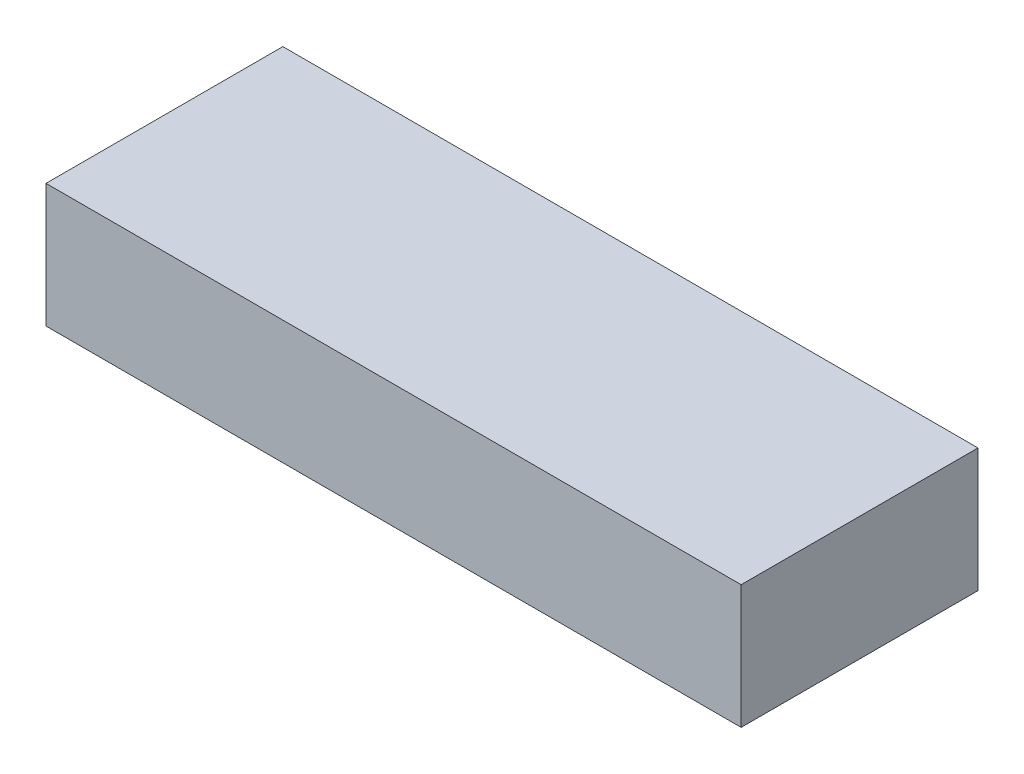
ISO-10303-21;
HEADER;
FILE_DESCRIPTION(('STEP AP214'),'2;1');
FILE_NAME('part.step','',(''),(''),'','','');
FILE_SCHEMA(('AUTOMOTIVE_DESIGN { 1 0 10303 214 1 1 1 1 }'));
ENDSEC;
DATA;
#1=APPLICATION_CONTEXT('core data for automotive mechanical design processes');
#2=APPLICATION_PROTOCOL_DEFINITION('international standard','automotive_design',2000,#1);
#3=PRODUCT_CONTEXT('',#1,'mechanical');
#4=PRODUCT('Part','Part','',(#3));
#5=PRODUCT_RELATED_PRODUCT_CATEGORY('part','',(#4));
#6=PRODUCT_DEFINITION_FORMATION('','',#4);
#7=PRODUCT_DEFINITION_CONTEXT('part definition',#1,'design');
#8=PRODUCT_DEFINITION('design','',#6,#7);
#9=PRODUCT_DEFINITION_SHAPE('','',#8);
#10=(LENGTH_UNIT() NAMED_UNIT(*) SI_UNIT(.MILLI.,.METRE.));
#11=(NAMED_UNIT(*) PLANE_ANGLE_UNIT() SI_UNIT($,.RADIAN.));
#12=(NAMED_UNIT(*) SI_UNIT($,.STERADIAN.) SOLID_ANGLE_UNIT());
#13=UNCERTAINTY_MEASURE_WITH_UNIT(LENGTH_MEASURE(1.E-05),#10,'distance_accuracy_value','');
#14=(GEOMETRIC_REPRESENTATION_CONTEXT(3) GLOBAL_UNCERTAINTY_ASSIGNED_CONTEXT((#13)) GLOBAL_UNIT_ASSIGNED_CONTEXT((#10,
#11,#12)) REPRESENTATION_CONTEXT('',''));
#15=CARTESIAN_POINT('',(0.,0.,0.));
#16=DIRECTION('',(0.,0.,1.));
#17=DIRECTION('',(1.,0.,0.));
#18=AXIS2_PLACEMENT_3D('',#15,#16,#17);
#19=CARTESIAN_POINT('',(67.5,12.,23.));
#20=DIRECTION('',(-1.,0.,0.));
#21=DIRECTION('',(0.,0.,1.));
#22=AXIS2_PLACEMENT_3D('',#19,#20,#21);
#23=PLANE('',#22);
#24=DIRECTION('',(0.,0.,-1.));
#25=VECTOR('',#24,1.);
#26=CARTESIAN_POINT('',(67.5,-12.,23.));
#27=LINE('',#26,#25);
#28=CARTESIAN_POINT('',(67.5,-12.,23.));
#29=VERTEX_POINT('',#28);
#30=CARTESIAN_POINT('',(67.5,-12.,-23.));
#31=VERTEX_POINT('',#30);
#32=EDGE_CURVE('E101',#29,#31,#27,.T.);
#33=ORIENTED_EDGE('',*,*,#32,.T.);
#34=DIRECTION('',(0.,-1.,0.));
#35=VECTOR('',#34,1.);
#36=CARTESIAN_POINT('',(67.5,12.,-23.));
#37=LINE('',#36,#35);
#38=CARTESIAN_POINT('',(67.5,12.,-23.));
#39=VERTEX_POINT('',#38);
#40=EDGE_CURVE('E11',#39,#31,#37,.T.);
#41=ORIENTED_EDGE('',*,*,#40,.F.);
#42=DIRECTION('',(0.,0.,-1.));
#43=VECTOR('',#42,1.);
#44=CARTESIAN_POINT('',(67.5,12.,23.));
#45=LINE('',#44,#43);
#46=CARTESIAN_POINT('',(67.5,12.,23.));
#47=VERTEX_POINT('',#46);
#48=EDGE_CURVE('E89',#47,#39,#45,.T.);
#49=ORIENTED_EDGE('',*,*,#48,.F.);
#50=DIRECTION('',(0.,-1.,0.));
#51=VECTOR('',#50,1.);
#52=CARTESIAN_POINT('',(67.5,12.,23.));
#53=LINE('',#52,#51);
#54=EDGE_CURVE('E97',#47,#29,#53,.T.);
#55=ORIENTED_EDGE('',*,*,#54,.T.);
#56=EDGE_LOOP('',(#33,#41,#49,#55));
#57=FACE_BOUND('',#56,.T.);
#58=ADVANCED_FACE('F38',(#57),#23,.F.);
#59=CARTESIAN_POINT('',(-67.5,12.,-23.));
#60=DIRECTION('',(0.,0.,1.));
#61=DIRECTION('',(1.,0.,0.));
#62=AXIS2_PLACEMENT_3D('',#59,#60,#61);
#63=PLANE('',#62);
#64=DIRECTION('',(-1.,0.,0.));
#65=VECTOR('',#64,1.);
#66=CARTESIAN_POINT('',(-67.5,-12.,-23.));
#67=LINE('',#66,#65);
#68=CARTESIAN_POINT('',(-67.5,-12.,-23.));
#69=VERTEX_POINT('',#68);
#70=EDGE_CURVE('E93',#31,#69,#67,.T.);
#71=ORIENTED_EDGE('',*,*,#70,.T.);
#72=DIRECTION('',(0.,-1.,0.));
#73=VECTOR('',#72,1.);
#74=CARTESIAN_POINT('',(-67.5,12.,-23.));
#75=LINE('',#74,#73);
#76=CARTESIAN_POINT('',(-67.5,12.,-23.));
#77=VERTEX_POINT('',#76);
#78=EDGE_CURVE('E46',#77,#69,#75,.T.);
#79=ORIENTED_EDGE('',*,*,#78,.F.);
#80=DIRECTION('',(-1.,0.,0.));
#81=VECTOR('',#80,1.);
#82=CARTESIAN_POINT('',(-67.5,12.,-23.));
#83=LINE('',#82,#81);
#84=EDGE_CURVE('E84',#39,#77,#83,.T.);
#85=ORIENTED_EDGE('',*,*,#84,.F.);
#86=ORIENTED_EDGE('',*,*,#40,.T.);
#87=EDGE_LOOP('',(#71,#79,#85,#86));
#88=FACE_BOUND('',#87,.T.);
#89=ADVANCED_FACE('F92',(#88),#63,.F.);
#90=CARTESIAN_POINT('',(-67.5,12.,23.));
#91=DIRECTION('',(1.,0.,0.));
#92=DIRECTION('',(0.,0.,-1.));
#93=AXIS2_PLACEMENT_3D('',#90,#91,#92);
#94=PLANE('',#93);
#95=DIRECTION('',(0.,0.,1.));
#96=VECTOR('',#95,1.);
#97=CARTESIAN_POINT('',(-67.5,-12.,23.));
#98=LINE('',#97,#96);
#99=CARTESIAN_POINT('',(-67.5,-12.,23.));
#100=VERTEX_POINT('',#99);
#101=EDGE_CURVE('E71',#69,#100,#98,.T.);
#102=ORIENTED_EDGE('',*,*,#101,.T.);
#103=DIRECTION('',(0.,-1.,0.));
#104=VECTOR('',#103,1.);
#105=CARTESIAN_POINT('',(-67.5,12.,23.));
#106=LINE('',#105,#104);
#107=CARTESIAN_POINT('',(-67.5,12.,23.));
#108=VERTEX_POINT('',#107);
#109=EDGE_CURVE('E94',#108,#100,#106,.T.);
#110=ORIENTED_EDGE('',*,*,#109,.F.);
#111=DIRECTION('',(0.,0.,1.));
#112=VECTOR('',#111,1.);
#113=CARTESIAN_POINT('',(-67.5,12.,23.));
#114=LINE('',#113,#112);
#115=EDGE_CURVE('E87',#77,#108,#114,.T.);
#116=ORIENTED_EDGE('',*,*,#115,.F.);
#117=ORIENTED_EDGE('',*,*,#78,.T.);
#118=EDGE_LOOP('',(#102,#110,#116,#117));
#119=FACE_BOUND('',#118,.T.);
#120=ADVANCED_FACE('F95',(#119),#94,.F.);
#121=CARTESIAN_POINT('',(-67.5,12.,23.));
#122=DIRECTION('',(0.,0.,-1.));
#123=DIRECTION('',(-1.,0.,0.));
#124=AXIS2_PLACEMENT_3D('',#121,#122,#123);
#125=PLANE('',#124);
#126=DIRECTION('',(1.,0.,0.));
#127=VECTOR('',#126,1.);
#128=CARTESIAN_POINT('',(-67.5,-12.,23.));
#129=LINE('',#128,#127);
#130=EDGE_CURVE('E77',#100,#29,#129,.T.);
#131=ORIENTED_EDGE('',*,*,#130,.T.);
#132=ORIENTED_EDGE('',*,*,#54,.F.);
#133=DIRECTION('',(1.,0.,0.));
#134=VECTOR('',#133,1.);
#135=CARTESIAN_POINT('',(-67.5,12.,23.));
#136=LINE('',#135,#134);
#137=EDGE_CURVE('E54',#108,#47,#136,.T.);
#138=ORIENTED_EDGE('',*,*,#137,.F.);
#139=ORIENTED_EDGE('',*,*,#109,.T.);
#140=EDGE_LOOP('',(#131,#132,#138,#139));
#141=FACE_BOUND('',#140,.T.);
#142=ADVANCED_FACE('F108',(#141),#125,.F.);
#143=CARTESIAN_POINT('',(0.,12.,0.));
#144=DIRECTION('',(0.,-1.,0.));
#145=DIRECTION('',(0.,0.,-1.));
#146=AXIS2_PLACEMENT_3D('',#143,#144,#145);
#147=PLANE('',#146);
#148=ORIENTED_EDGE('',*,*,#48,.T.);
#149=ORIENTED_EDGE('',*,*,#84,.T.);
#150=ORIENTED_EDGE('',*,*,#115,.T.);
#151=ORIENTED_EDGE('',*,*,#137,.T.);
#152=EDGE_LOOP('',(#148,#149,#150,#151));
#153=FACE_BOUND('',#152,.T.);
#154=ADVANCED_FACE('F85',(#153),#147,.F.);
#155=CARTESIAN_POINT('',(0.,-12.,0.));
#156=DIRECTION('',(0.,-1.,0.));
#157=DIRECTION('',(0.,0.,-1.));
#158=AXIS2_PLACEMENT_3D('',#155,#156,#157);
#159=PLANE('',#158);
#160=ORIENTED_EDGE('',*,*,#32,.F.);
#161=ORIENTED_EDGE('',*,*,#130,.F.);
#162=ORIENTED_EDGE('',*,*,#101,.F.);
#163=ORIENTED_EDGE('',*,*,#70,.F.);
#164=EDGE_LOOP('',(#160,#161,#162,#163));
#165=FACE_BOUND('',#164,.T.);
#166=ADVANCED_FACE('F111',(#165),#159,.T.);
#167=CLOSED_SHELL('',(#58,#89,#120,#142,#154,#166));
#168=MANIFOLD_SOLID_BREP('B2',#167);
#169=ADVANCED_BREP_SHAPE_REPRESENTATION('',(#18,#168),#14);
#170=SHAPE_DEFINITION_REPRESENTATION(#9,#169);
ENDSEC;
END-ISO-10303-21;
